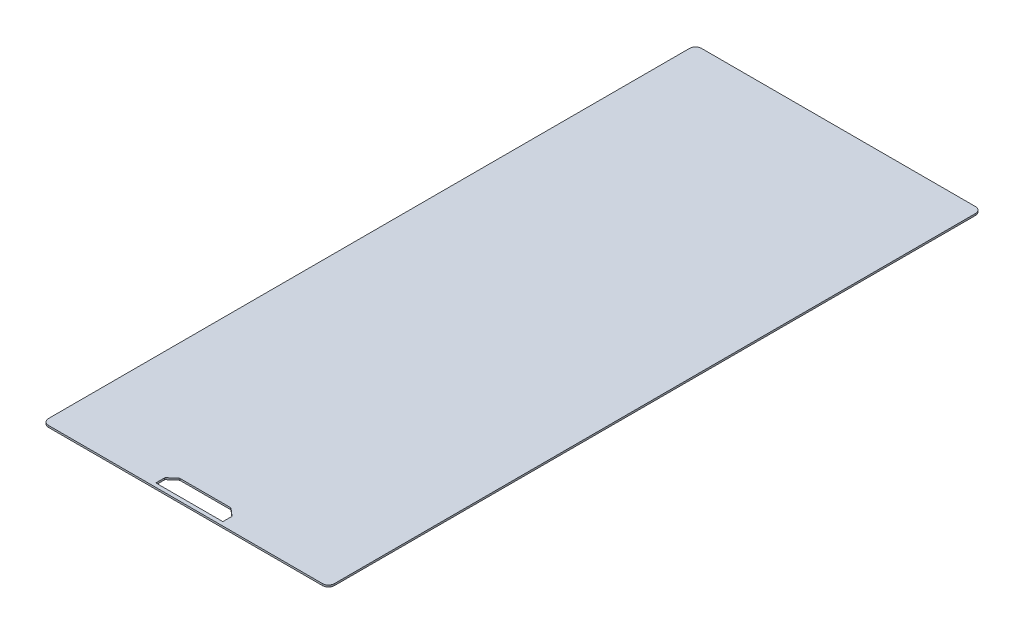
ISO-10303-21;
HEADER;
FILE_DESCRIPTION(('STEP AP214'),'2;1');
FILE_NAME('part.step','',(''),(''),'','','');
FILE_SCHEMA(('AUTOMOTIVE_DESIGN { 1 0 10303 214 1 1 1 1 }'));
ENDSEC;
DATA;
#1=APPLICATION_CONTEXT('core data for automotive mechanical design processes');
#2=APPLICATION_PROTOCOL_DEFINITION('international standard','automotive_design',2000,#1);
#3=PRODUCT_CONTEXT('',#1,'mechanical');
#4=PRODUCT('Part','Part','',(#3));
#5=PRODUCT_RELATED_PRODUCT_CATEGORY('part','',(#4));
#6=PRODUCT_DEFINITION_FORMATION('','',#4);
#7=PRODUCT_DEFINITION_CONTEXT('part definition',#1,'design');
#8=PRODUCT_DEFINITION('design','',#6,#7);
#9=PRODUCT_DEFINITION_SHAPE('','',#8);
#10=(LENGTH_UNIT() NAMED_UNIT(*) SI_UNIT(.MILLI.,.METRE.));
#11=(NAMED_UNIT(*) PLANE_ANGLE_UNIT() SI_UNIT($,.RADIAN.));
#12=(NAMED_UNIT(*) SI_UNIT($,.STERADIAN.) SOLID_ANGLE_UNIT());
#13=UNCERTAINTY_MEASURE_WITH_UNIT(LENGTH_MEASURE(1.E-05),#10,'distance_accuracy_value','');
#14=(GEOMETRIC_REPRESENTATION_CONTEXT(3) GLOBAL_UNCERTAINTY_ASSIGNED_CONTEXT((#13)) GLOBAL_UNIT_ASSIGNED_CONTEXT((#10,
#11,#12)) REPRESENTATION_CONTEXT('',''));
#15=CARTESIAN_POINT('',(0.,0.,0.));
#16=DIRECTION('',(0.,0.,1.));
#17=DIRECTION('',(1.,0.,0.));
#18=AXIS2_PLACEMENT_3D('',#15,#16,#17);
#19=CARTESIAN_POINT('',(231.5,3.,541.5));
#20=DIRECTION('',(0.,-1.,0.));
#21=DIRECTION('',(0.,0.,-1.));
#22=AXIS2_PLACEMENT_3D('',#19,#20,#21);
#23=CYLINDRICAL_SURFACE('',#22,10.);
#24=CARTESIAN_POINT('',(231.5,0.,541.5));
#25=DIRECTION('',(0.,1.,0.));
#26=DIRECTION('',(0.,0.,1.));
#27=AXIS2_PLACEMENT_3D('',#24,#25,#26);
#28=CIRCLE('',#27,10.);
#29=CARTESIAN_POINT('',(231.5,0.,551.5));
#30=VERTEX_POINT('',#29);
#31=CARTESIAN_POINT('',(241.5,0.,541.5));
#32=VERTEX_POINT('',#31);
#33=EDGE_CURVE('E254',#30,#32,#28,.T.);
#34=ORIENTED_EDGE('',*,*,#33,.T.);
#35=DIRECTION('',(0.,-1.,0.));
#36=VECTOR('',#35,1.);
#37=CARTESIAN_POINT('',(241.5,3.,541.5));
#38=LINE('',#37,#36);
#39=CARTESIAN_POINT('',(241.5,3.,541.5));
#40=VERTEX_POINT('',#39);
#41=EDGE_CURVE('E11',#40,#32,#38,.T.);
#42=ORIENTED_EDGE('',*,*,#41,.F.);
#43=CARTESIAN_POINT('',(231.5,3.,541.5));
#44=DIRECTION('',(0.,1.,0.));
#45=DIRECTION('',(0.,0.,1.));
#46=AXIS2_PLACEMENT_3D('',#43,#44,#45);
#47=CIRCLE('',#46,10.);
#48=CARTESIAN_POINT('',(231.5,3.,551.5));
#49=VERTEX_POINT('',#48);
#50=EDGE_CURVE('E278',#49,#40,#47,.T.);
#51=ORIENTED_EDGE('',*,*,#50,.F.);
#52=DIRECTION('',(0.,-1.,0.));
#53=VECTOR('',#52,1.);
#54=CARTESIAN_POINT('',(231.5,3.,551.5));
#55=LINE('',#54,#53);
#56=EDGE_CURVE('E304',#49,#30,#55,.T.);
#57=ORIENTED_EDGE('',*,*,#56,.T.);
#58=EDGE_LOOP('',(#34,#42,#51,#57));
#59=FACE_BOUND('',#58,.T.);
#60=ADVANCED_FACE('F38',(#59),#23,.T.);
#61=CARTESIAN_POINT('',(241.5,3.,541.5));
#62=DIRECTION('',(-1.,0.,0.));
#63=DIRECTION('',(0.,0.,1.));
#64=AXIS2_PLACEMENT_3D('',#61,#62,#63);
#65=PLANE('',#64);
#66=DIRECTION('',(0.,0.,-1.));
#67=VECTOR('',#66,1.);
#68=CARTESIAN_POINT('',(241.5,0.,541.5));
#69=LINE('',#68,#67);
#70=CARTESIAN_POINT('',(241.5,0.,-541.5));
#71=VERTEX_POINT('',#70);
#72=EDGE_CURVE('E308',#32,#71,#69,.T.);
#73=ORIENTED_EDGE('',*,*,#72,.T.);
#74=DIRECTION('',(0.,-1.,0.));
#75=VECTOR('',#74,1.);
#76=CARTESIAN_POINT('',(241.5,3.,-541.5));
#77=LINE('',#76,#75);
#78=CARTESIAN_POINT('',(241.5,3.,-541.5));
#79=VERTEX_POINT('',#78);
#80=EDGE_CURVE('E46',#79,#71,#77,.T.);
#81=ORIENTED_EDGE('',*,*,#80,.F.);
#82=DIRECTION('',(0.,0.,-1.));
#83=VECTOR('',#82,1.);
#84=CARTESIAN_POINT('',(241.5,3.,541.5));
#85=LINE('',#84,#83);
#86=EDGE_CURVE('E282',#40,#79,#85,.T.);
#87=ORIENTED_EDGE('',*,*,#86,.F.);
#88=ORIENTED_EDGE('',*,*,#41,.T.);
#89=EDGE_LOOP('',(#73,#81,#87,#88));
#90=FACE_BOUND('',#89,.T.);
#91=ADVANCED_FACE('F377',(#90),#65,.F.);
#92=CARTESIAN_POINT('',(231.5,3.,-541.5));
#93=DIRECTION('',(0.,-1.,0.));
#94=DIRECTION('',(0.,0.,-1.));
#95=AXIS2_PLACEMENT_3D('',#92,#93,#94);
#96=CYLINDRICAL_SURFACE('',#95,10.);
#97=CARTESIAN_POINT('',(231.5,0.,-541.5));
#98=DIRECTION('',(0.,1.,0.));
#99=DIRECTION('',(0.,0.,-1.));
#100=AXIS2_PLACEMENT_3D('',#97,#98,#99);
#101=CIRCLE('',#100,10.);
#102=CARTESIAN_POINT('',(231.5,0.,-551.5));
#103=VERTEX_POINT('',#102);
#104=EDGE_CURVE('E311',#71,#103,#101,.T.);
#105=ORIENTED_EDGE('',*,*,#104,.T.);
#106=DIRECTION('',(0.,-1.,0.));
#107=VECTOR('',#106,1.);
#108=CARTESIAN_POINT('',(231.5,3.,-551.5));
#109=LINE('',#108,#107);
#110=CARTESIAN_POINT('',(231.5,3.,-551.5));
#111=VERTEX_POINT('',#110);
#112=EDGE_CURVE('E347',#111,#103,#109,.T.);
#113=ORIENTED_EDGE('',*,*,#112,.F.);
#114=CARTESIAN_POINT('',(231.5,3.,-541.5));
#115=DIRECTION('',(0.,1.,0.));
#116=DIRECTION('',(0.,0.,-1.));
#117=AXIS2_PLACEMENT_3D('',#114,#115,#116);
#118=CIRCLE('',#117,10.);
#119=EDGE_CURVE('E286',#79,#111,#118,.T.);
#120=ORIENTED_EDGE('',*,*,#119,.F.);
#121=ORIENTED_EDGE('',*,*,#80,.T.);
#122=EDGE_LOOP('',(#105,#113,#120,#121));
#123=FACE_BOUND('',#122,.T.);
#124=ADVANCED_FACE('F356',(#123),#96,.T.);
#125=CARTESIAN_POINT('',(-231.5,3.,-551.5));
#126=DIRECTION('',(0.,0.,1.));
#127=DIRECTION('',(1.,0.,0.));
#128=AXIS2_PLACEMENT_3D('',#125,#126,#127);
#129=PLANE('',#128);
#130=DIRECTION('',(-1.,0.,0.));
#131=VECTOR('',#130,1.);
#132=CARTESIAN_POINT('',(-231.5,0.,-551.5));
#133=LINE('',#132,#131);
#134=CARTESIAN_POINT('',(-231.5,0.,-551.5));
#135=VERTEX_POINT('',#134);
#136=EDGE_CURVE('E314',#103,#135,#133,.T.);
#137=ORIENTED_EDGE('',*,*,#136,.T.);
#138=DIRECTION('',(0.,-1.,0.));
#139=VECTOR('',#138,1.);
#140=CARTESIAN_POINT('',(-231.5,3.,-551.5));
#141=LINE('',#140,#139);
#142=CARTESIAN_POINT('',(-231.5,3.,-551.5));
#143=VERTEX_POINT('',#142);
#144=EDGE_CURVE('E343',#143,#135,#141,.T.);
#145=ORIENTED_EDGE('',*,*,#144,.F.);
#146=DIRECTION('',(-1.,0.,0.));
#147=VECTOR('',#146,1.);
#148=CARTESIAN_POINT('',(-231.5,3.,-551.5));
#149=LINE('',#148,#147);
#150=EDGE_CURVE('E289',#111,#143,#149,.T.);
#151=ORIENTED_EDGE('',*,*,#150,.F.);
#152=ORIENTED_EDGE('',*,*,#112,.T.);
#153=EDGE_LOOP('',(#137,#145,#151,#152));
#154=FACE_BOUND('',#153,.T.);
#155=ADVANCED_FACE('F365',(#154),#129,.F.);
#156=CARTESIAN_POINT('',(-231.5,3.,-541.5));
#157=DIRECTION('',(0.,-1.,0.));
#158=DIRECTION('',(0.,0.,-1.));
#159=AXIS2_PLACEMENT_3D('',#156,#157,#158);
#160=CYLINDRICAL_SURFACE('',#159,10.);
#161=CARTESIAN_POINT('',(-231.5,0.,-541.5));
#162=DIRECTION('',(0.,1.,0.));
#163=DIRECTION('',(0.,0.,-1.));
#164=AXIS2_PLACEMENT_3D('',#161,#162,#163);
#165=CIRCLE('',#164,10.);
#166=CARTESIAN_POINT('',(-241.5,0.,-541.5));
#167=VERTEX_POINT('',#166);
#168=EDGE_CURVE('E317',#135,#167,#165,.T.);
#169=ORIENTED_EDGE('',*,*,#168,.T.);
#170=DIRECTION('',(0.,-1.,0.));
#171=VECTOR('',#170,1.);
#172=CARTESIAN_POINT('',(-241.5,3.,-541.5));
#173=LINE('',#172,#171);
#174=CARTESIAN_POINT('',(-241.5,3.,-541.5));
#175=VERTEX_POINT('',#174);
#176=EDGE_CURVE('E339',#175,#167,#173,.T.);
#177=ORIENTED_EDGE('',*,*,#176,.F.);
#178=CARTESIAN_POINT('',(-231.5,3.,-541.5));
#179=DIRECTION('',(0.,1.,0.));
#180=DIRECTION('',(0.,0.,-1.));
#181=AXIS2_PLACEMENT_3D('',#178,#179,#180);
#182=CIRCLE('',#181,10.);
#183=EDGE_CURVE('E292',#143,#175,#182,.T.);
#184=ORIENTED_EDGE('',*,*,#183,.F.);
#185=ORIENTED_EDGE('',*,*,#144,.T.);
#186=EDGE_LOOP('',(#169,#177,#184,#185));
#187=FACE_BOUND('',#186,.T.);
#188=ADVANCED_FACE('F369',(#187),#160,.T.);
#189=CARTESIAN_POINT('',(-241.5,3.,541.5));
#190=DIRECTION('',(1.,0.,0.));
#191=DIRECTION('',(0.,0.,-1.));
#192=AXIS2_PLACEMENT_3D('',#189,#190,#191);
#193=PLANE('',#192);
#194=DIRECTION('',(0.,0.,1.));
#195=VECTOR('',#194,1.);
#196=CARTESIAN_POINT('',(-241.5,0.,541.5));
#197=LINE('',#196,#195);
#198=CARTESIAN_POINT('',(-241.5,0.,541.5));
#199=VERTEX_POINT('',#198);
#200=EDGE_CURVE('E320',#167,#199,#197,.T.);
#201=ORIENTED_EDGE('',*,*,#200,.T.);
#202=DIRECTION('',(0.,-1.,0.));
#203=VECTOR('',#202,1.);
#204=CARTESIAN_POINT('',(-241.5,3.,541.5));
#205=LINE('',#204,#203);
#206=CARTESIAN_POINT('',(-241.5,3.,541.5));
#207=VERTEX_POINT('',#206);
#208=EDGE_CURVE('E335',#207,#199,#205,.T.);
#209=ORIENTED_EDGE('',*,*,#208,.F.);
#210=DIRECTION('',(0.,0.,1.));
#211=VECTOR('',#210,1.);
#212=CARTESIAN_POINT('',(-241.5,3.,541.5));
#213=LINE('',#212,#211);
#214=EDGE_CURVE('E295',#175,#207,#213,.T.);
#215=ORIENTED_EDGE('',*,*,#214,.F.);
#216=ORIENTED_EDGE('',*,*,#176,.T.);
#217=EDGE_LOOP('',(#201,#209,#215,#216));
#218=FACE_BOUND('',#217,.T.);
#219=ADVANCED_FACE('F390',(#218),#193,.F.);
#220=CARTESIAN_POINT('',(-231.5,3.,541.5));
#221=DIRECTION('',(0.,-1.,0.));
#222=DIRECTION('',(0.,0.,-1.));
#223=AXIS2_PLACEMENT_3D('',#220,#221,#222);
#224=CYLINDRICAL_SURFACE('',#223,10.);
#225=CARTESIAN_POINT('',(-231.5,0.,541.5));
#226=DIRECTION('',(0.,1.,0.));
#227=DIRECTION('',(0.,0.,-1.));
#228=AXIS2_PLACEMENT_3D('',#225,#226,#227);
#229=CIRCLE('',#228,10.);
#230=CARTESIAN_POINT('',(-231.5,0.,551.5));
#231=VERTEX_POINT('',#230);
#232=EDGE_CURVE('E323',#199,#231,#229,.T.);
#233=ORIENTED_EDGE('',*,*,#232,.T.);
#234=DIRECTION('',(0.,-1.,0.));
#235=VECTOR('',#234,1.);
#236=CARTESIAN_POINT('',(-231.5,3.,551.5));
#237=LINE('',#236,#235);
#238=CARTESIAN_POINT('',(-231.5,3.,551.5));
#239=VERTEX_POINT('',#238);
#240=EDGE_CURVE('E331',#239,#231,#237,.T.);
#241=ORIENTED_EDGE('',*,*,#240,.F.);
#242=CARTESIAN_POINT('',(-231.5,3.,541.5));
#243=DIRECTION('',(0.,1.,0.));
#244=DIRECTION('',(0.,0.,-1.));
#245=AXIS2_PLACEMENT_3D('',#242,#243,#244);
#246=CIRCLE('',#245,10.);
#247=EDGE_CURVE('E298',#207,#239,#246,.T.);
#248=ORIENTED_EDGE('',*,*,#247,.F.);
#249=ORIENTED_EDGE('',*,*,#208,.T.);
#250=EDGE_LOOP('',(#233,#241,#248,#249));
#251=FACE_BOUND('',#250,.T.);
#252=ADVANCED_FACE('F388',(#251),#224,.T.);
#253=CARTESIAN_POINT('',(-231.5,3.,551.5));
#254=DIRECTION('',(0.,0.,-1.));
#255=DIRECTION('',(-1.,0.,0.));
#256=AXIS2_PLACEMENT_3D('',#253,#254,#255);
#257=PLANE('',#256);
#258=DIRECTION('',(1.,0.,0.));
#259=VECTOR('',#258,1.);
#260=CARTESIAN_POINT('',(-231.5,0.,551.5));
#261=LINE('',#260,#259);
#262=EDGE_CURVE('E283',#231,#30,#261,.T.);
#263=ORIENTED_EDGE('',*,*,#262,.T.);
#264=ORIENTED_EDGE('',*,*,#56,.F.);
#265=DIRECTION('',(1.,0.,0.));
#266=VECTOR('',#265,1.);
#267=CARTESIAN_POINT('',(-231.5,3.,551.5));
#268=LINE('',#267,#266);
#269=EDGE_CURVE('E301',#239,#49,#268,.T.);
#270=ORIENTED_EDGE('',*,*,#269,.F.);
#271=ORIENTED_EDGE('',*,*,#240,.T.);
#272=EDGE_LOOP('',(#263,#264,#270,#271));
#273=FACE_BOUND('',#272,.T.);
#274=ADVANCED_FACE('F383',(#273),#257,.F.);
#275=CARTESIAN_POINT('',(231.5,3.,541.5));
#276=DIRECTION('',(0.,1.,0.));
#277=DIRECTION('',(0.,0.,1.));
#278=AXIS2_PLACEMENT_3D('',#275,#276,#277);
#279=PLANE('',#278);
#280=DIRECTION('',(0.,0.,-1.));
#281=VECTOR('',#280,1.);
#282=CARTESIAN_POINT('',(56.625,3.,545.));
#283=LINE('',#282,#281);
#284=CARTESIAN_POINT('',(56.625,3.,545.));
#285=VERTEX_POINT('',#284);
#286=CARTESIAN_POINT('',(56.625,3.,530.644630073536));
#287=VERTEX_POINT('',#286);
#288=EDGE_CURVE('E53',#285,#287,#283,.T.);
#289=ORIENTED_EDGE('',*,*,#288,.F.);
#290=DIRECTION('',(1.,0.,0.));
#291=VECTOR('',#290,1.);
#292=CARTESIAN_POINT('',(-56.625,3.,545.));
#293=LINE('',#292,#291);
#294=CARTESIAN_POINT('',(-56.625,3.,545.));
#295=VERTEX_POINT('',#294);
#296=EDGE_CURVE('E185',#295,#285,#293,.T.);
#297=ORIENTED_EDGE('',*,*,#296,.F.);
#298=DIRECTION('',(0.,0.,1.));
#299=VECTOR('',#298,1.);
#300=CARTESIAN_POINT('',(-56.625,3.,530.644630073536));
#301=LINE('',#300,#299);
#302=CARTESIAN_POINT('',(-56.625,3.,530.644630073536));
#303=VERTEX_POINT('',#302);
#304=EDGE_CURVE('E189',#303,#295,#301,.T.);
#305=ORIENTED_EDGE('',*,*,#304,.F.);
#306=CARTESIAN_POINT('',(-54.125,3.,530.644630073536));
#307=DIRECTION('',(0.,1.,0.));
#308=DIRECTION('',(0.,0.,1.));
#309=AXIS2_PLACEMENT_3D('',#306,#307,#308);
#310=CIRCLE('',#309,2.49999999999994);
#311=CARTESIAN_POINT('',(-55.7585005575696,3.,528.752098454667));
#312=VERTEX_POINT('',#311);
#313=EDGE_CURVE('E244',#312,#303,#310,.T.);
#314=ORIENTED_EDGE('',*,*,#313,.F.);
#315=DIRECTION('',(-0.757012647547708,0.,0.653400223027824));
#316=VECTOR('',#315,1.);
#317=CARTESIAN_POINT('',(-44.0051937791101,3.,518.607468381131));
#318=LINE('',#317,#316);
#319=CARTESIAN_POINT('',(-44.0051937791101,3.,518.607468381131));
#320=VERTEX_POINT('',#319);
#321=EDGE_CURVE('E240',#320,#312,#318,.T.);
#322=ORIENTED_EDGE('',*,*,#321,.F.);
#323=CARTESIAN_POINT('',(-42.3716932215407,3.,520.5));
#324=DIRECTION('',(0.,1.,0.));
#325=DIRECTION('',(0.,0.,1.));
#326=AXIS2_PLACEMENT_3D('',#323,#324,#325);
#327=CIRCLE('',#326,2.4999999999999);
#328=CARTESIAN_POINT('',(-42.3716932215407,3.,518.));
#329=VERTEX_POINT('',#328);
#330=EDGE_CURVE('E236',#329,#320,#327,.T.);
#331=ORIENTED_EDGE('',*,*,#330,.F.);
#332=DIRECTION('',(-1.,0.,0.));
#333=VECTOR('',#332,1.);
#334=CARTESIAN_POINT('',(42.3716932215407,3.,518.));
#335=LINE('',#334,#333);
#336=CARTESIAN_POINT('',(42.3716932215407,3.,518.));
#337=VERTEX_POINT('',#336);
#338=EDGE_CURVE('E232',#337,#329,#335,.T.);
#339=ORIENTED_EDGE('',*,*,#338,.F.);
#340=CARTESIAN_POINT('',(42.3716932215407,3.,520.5));
#341=DIRECTION('',(0.,1.,0.));
#342=DIRECTION('',(0.,0.,1.));
#343=AXIS2_PLACEMENT_3D('',#340,#341,#342);
#344=CIRCLE('',#343,2.49999999999997);
#345=CARTESIAN_POINT('',(44.0051937791102,3.,518.607468381131));
#346=VERTEX_POINT('',#345);
#347=EDGE_CURVE('E228',#346,#337,#344,.T.);
#348=ORIENTED_EDGE('',*,*,#347,.F.);
#349=DIRECTION('',(-0.757012647547708,0.,-0.653400223027824));
#350=VECTOR('',#349,1.);
#351=CARTESIAN_POINT('',(55.7585005575696,3.,528.752098454667));
#352=LINE('',#351,#350);
#353=CARTESIAN_POINT('',(55.7585005575696,3.,528.752098454667));
#354=VERTEX_POINT('',#353);
#355=EDGE_CURVE('E224',#354,#346,#352,.T.);
#356=ORIENTED_EDGE('',*,*,#355,.F.);
#357=CARTESIAN_POINT('',(54.125,3.,530.644630073536));
#358=DIRECTION('',(0.,1.,0.));
#359=DIRECTION('',(0.,0.,1.));
#360=AXIS2_PLACEMENT_3D('',#357,#358,#359);
#361=CIRCLE('',#360,2.50000000000001);
#362=EDGE_CURVE('E221',#287,#354,#361,.T.);
#363=ORIENTED_EDGE('',*,*,#362,.F.);
#364=EDGE_LOOP('',(#289,#297,#305,#314,#322,#331,#339,#348,#356,#363));
#365=FACE_BOUND('',#364,.T.);
#366=ORIENTED_EDGE('',*,*,#50,.T.);
#367=ORIENTED_EDGE('',*,*,#86,.T.);
#368=ORIENTED_EDGE('',*,*,#119,.T.);
#369=ORIENTED_EDGE('',*,*,#150,.T.);
#370=ORIENTED_EDGE('',*,*,#183,.T.);
#371=ORIENTED_EDGE('',*,*,#214,.T.);
#372=ORIENTED_EDGE('',*,*,#247,.T.);
#373=ORIENTED_EDGE('',*,*,#269,.T.);
#374=EDGE_LOOP('',(#366,#367,#368,#369,#370,#371,#372,#373));
#375=FACE_BOUND('',#374,.T.);
#376=ADVANCED_FACE('F373',(#365,#375),#279,.T.);
#377=CARTESIAN_POINT('',(231.5,0.,541.5));
#378=DIRECTION('',(0.,1.,0.));
#379=DIRECTION('',(0.,0.,1.));
#380=AXIS2_PLACEMENT_3D('',#377,#378,#379);
#381=PLANE('',#380);
#382=DIRECTION('',(1.,0.,0.));
#383=VECTOR('',#382,1.);
#384=CARTESIAN_POINT('',(-56.625,0.,545.));
#385=LINE('',#384,#383);
#386=CARTESIAN_POINT('',(-56.625,0.,545.));
#387=VERTEX_POINT('',#386);
#388=CARTESIAN_POINT('',(56.625,0.,545.));
#389=VERTEX_POINT('',#388);
#390=EDGE_CURVE('E172',#387,#389,#385,.T.);
#391=ORIENTED_EDGE('',*,*,#390,.T.);
#392=DIRECTION('',(0.,0.,-1.));
#393=VECTOR('',#392,1.);
#394=CARTESIAN_POINT('',(56.625,0.,545.));
#395=LINE('',#394,#393);
#396=CARTESIAN_POINT('',(56.625,0.,530.644630073536));
#397=VERTEX_POINT('',#396);
#398=EDGE_CURVE('E165',#389,#397,#395,.T.);
#399=ORIENTED_EDGE('',*,*,#398,.T.);
#400=CARTESIAN_POINT('',(54.125,0.,530.644630073536));
#401=DIRECTION('',(0.,1.,0.));
#402=DIRECTION('',(0.,0.,1.));
#403=AXIS2_PLACEMENT_3D('',#400,#401,#402);
#404=CIRCLE('',#403,2.50000000000001);
#405=CARTESIAN_POINT('',(55.7585005575696,0.,528.752098454667));
#406=VERTEX_POINT('',#405);
#407=EDGE_CURVE('E175',#397,#406,#404,.T.);
#408=ORIENTED_EDGE('',*,*,#407,.T.);
#409=DIRECTION('',(-0.757012647547708,0.,-0.653400223027824));
#410=VECTOR('',#409,1.);
#411=CARTESIAN_POINT('',(55.7585005575696,0.,528.752098454667));
#412=LINE('',#411,#410);
#413=CARTESIAN_POINT('',(44.0051937791102,0.,518.607468381131));
#414=VERTEX_POINT('',#413);
#415=EDGE_CURVE('E61',#406,#414,#412,.T.);
#416=ORIENTED_EDGE('',*,*,#415,.T.);
#417=CARTESIAN_POINT('',(42.3716932215407,0.,520.5));
#418=DIRECTION('',(0.,1.,0.));
#419=DIRECTION('',(0.,0.,1.));
#420=AXIS2_PLACEMENT_3D('',#417,#418,#419);
#421=CIRCLE('',#420,2.49999999999997);
#422=CARTESIAN_POINT('',(42.3716932215407,0.,518.));
#423=VERTEX_POINT('',#422);
#424=EDGE_CURVE('E194',#414,#423,#421,.T.);
#425=ORIENTED_EDGE('',*,*,#424,.T.);
#426=DIRECTION('',(-1.,0.,0.));
#427=VECTOR('',#426,1.);
#428=CARTESIAN_POINT('',(42.3716932215407,0.,518.));
#429=LINE('',#428,#427);
#430=CARTESIAN_POINT('',(-42.3716932215407,0.,518.));
#431=VERTEX_POINT('',#430);
#432=EDGE_CURVE('E198',#423,#431,#429,.T.);
#433=ORIENTED_EDGE('',*,*,#432,.T.);
#434=CARTESIAN_POINT('',(-42.3716932215407,0.,520.5));
#435=DIRECTION('',(0.,1.,0.));
#436=DIRECTION('',(0.,0.,1.));
#437=AXIS2_PLACEMENT_3D('',#434,#435,#436);
#438=CIRCLE('',#437,2.4999999999999);
#439=CARTESIAN_POINT('',(-44.0051937791101,0.,518.607468381131));
#440=VERTEX_POINT('',#439);
#441=EDGE_CURVE('E202',#431,#440,#438,.T.);
#442=ORIENTED_EDGE('',*,*,#441,.T.);
#443=DIRECTION('',(-0.757012647547708,0.,0.653400223027824));
#444=VECTOR('',#443,1.);
#445=CARTESIAN_POINT('',(-44.0051937791101,0.,518.607468381131));
#446=LINE('',#445,#444);
#447=CARTESIAN_POINT('',(-55.7585005575696,0.,528.752098454667));
#448=VERTEX_POINT('',#447);
#449=EDGE_CURVE('E206',#440,#448,#446,.T.);
#450=ORIENTED_EDGE('',*,*,#449,.T.);
#451=CARTESIAN_POINT('',(-54.125,0.,530.644630073536));
#452=DIRECTION('',(0.,1.,0.));
#453=DIRECTION('',(0.,0.,1.));
#454=AXIS2_PLACEMENT_3D('',#451,#452,#453);
#455=CIRCLE('',#454,2.49999999999994);
#456=CARTESIAN_POINT('',(-56.625,0.,530.644630073536));
#457=VERTEX_POINT('',#456);
#458=EDGE_CURVE('E210',#448,#457,#455,.T.);
#459=ORIENTED_EDGE('',*,*,#458,.T.);
#460=DIRECTION('',(0.,0.,1.));
#461=VECTOR('',#460,1.);
#462=CARTESIAN_POINT('',(-56.625,0.,530.644630073536));
#463=LINE('',#462,#461);
#464=EDGE_CURVE('E214',#457,#387,#463,.T.);
#465=ORIENTED_EDGE('',*,*,#464,.T.);
#466=EDGE_LOOP('',(#391,#399,#408,#416,#425,#433,#442,#450,#459,#465));
#467=FACE_BOUND('',#466,.T.);
#468=ORIENTED_EDGE('',*,*,#33,.F.);
#469=ORIENTED_EDGE('',*,*,#262,.F.);
#470=ORIENTED_EDGE('',*,*,#232,.F.);
#471=ORIENTED_EDGE('',*,*,#200,.F.);
#472=ORIENTED_EDGE('',*,*,#168,.F.);
#473=ORIENTED_EDGE('',*,*,#136,.F.);
#474=ORIENTED_EDGE('',*,*,#104,.F.);
#475=ORIENTED_EDGE('',*,*,#72,.F.);
#476=EDGE_LOOP('',(#468,#469,#470,#471,#472,#473,#474,#475));
#477=FACE_BOUND('',#476,.T.);
#478=ADVANCED_FACE('F180',(#467,#477),#381,.F.);
#479=CARTESIAN_POINT('',(56.625,0.,545.));
#480=DIRECTION('',(1.,0.,0.));
#481=DIRECTION('',(0.,0.,-1.));
#482=AXIS2_PLACEMENT_3D('',#479,#480,#481);
#483=PLANE('',#482);
#484=ORIENTED_EDGE('',*,*,#288,.T.);
#485=DIRECTION('',(0.,1.,0.));
#486=VECTOR('',#485,1.);
#487=CARTESIAN_POINT('',(56.625,0.,530.644630073536));
#488=LINE('',#487,#486);
#489=EDGE_CURVE('E161',#397,#287,#488,.T.);
#490=ORIENTED_EDGE('',*,*,#489,.F.);
#491=ORIENTED_EDGE('',*,*,#398,.F.);
#492=DIRECTION('',(0.,1.,0.));
#493=VECTOR('',#492,1.);
#494=CARTESIAN_POINT('',(56.625,0.,545.));
#495=LINE('',#494,#493);
#496=EDGE_CURVE('E251',#389,#285,#495,.T.);
#497=ORIENTED_EDGE('',*,*,#496,.T.);
#498=EDGE_LOOP('',(#484,#490,#491,#497));
#499=FACE_BOUND('',#498,.T.);
#500=ADVANCED_FACE('F163',(#499),#483,.F.);
#501=CARTESIAN_POINT('',(-56.625,0.,545.));
#502=DIRECTION('',(0.,0.,1.));
#503=DIRECTION('',(1.,0.,0.));
#504=AXIS2_PLACEMENT_3D('',#501,#502,#503);
#505=PLANE('',#504);
#506=ORIENTED_EDGE('',*,*,#296,.T.);
#507=ORIENTED_EDGE('',*,*,#496,.F.);
#508=ORIENTED_EDGE('',*,*,#390,.F.);
#509=DIRECTION('',(0.,1.,0.));
#510=VECTOR('',#509,1.);
#511=CARTESIAN_POINT('',(-56.625,0.,545.));
#512=LINE('',#511,#510);
#513=EDGE_CURVE('E255',#387,#295,#512,.T.);
#514=ORIENTED_EDGE('',*,*,#513,.T.);
#515=EDGE_LOOP('',(#506,#507,#508,#514));
#516=FACE_BOUND('',#515,.T.);
#517=ADVANCED_FACE('F461',(#516),#505,.F.);
#518=CARTESIAN_POINT('',(-56.625,0.,530.644630073536));
#519=DIRECTION('',(-1.,0.,0.));
#520=DIRECTION('',(0.,0.,1.));
#521=AXIS2_PLACEMENT_3D('',#518,#519,#520);
#522=PLANE('',#521);
#523=ORIENTED_EDGE('',*,*,#304,.T.);
#524=ORIENTED_EDGE('',*,*,#513,.F.);
#525=ORIENTED_EDGE('',*,*,#464,.F.);
#526=DIRECTION('',(0.,1.,0.));
#527=VECTOR('',#526,1.);
#528=CARTESIAN_POINT('',(-56.625,0.,530.644630073536));
#529=LINE('',#528,#527);
#530=EDGE_CURVE('E258',#457,#303,#529,.T.);
#531=ORIENTED_EDGE('',*,*,#530,.T.);
#532=EDGE_LOOP('',(#523,#524,#525,#531));
#533=FACE_BOUND('',#532,.T.);
#534=ADVANCED_FACE('F470',(#533),#522,.F.);
#535=CARTESIAN_POINT('',(-54.125,0.,530.644630073536));
#536=DIRECTION('',(0.,1.,0.));
#537=DIRECTION('',(0.,0.,1.));
#538=AXIS2_PLACEMENT_3D('',#535,#536,#537);
#539=CYLINDRICAL_SURFACE('',#538,2.49999999999994);
#540=ORIENTED_EDGE('',*,*,#313,.T.);
#541=ORIENTED_EDGE('',*,*,#530,.F.);
#542=ORIENTED_EDGE('',*,*,#458,.F.);
#543=DIRECTION('',(0.,1.,0.));
#544=VECTOR('',#543,1.);
#545=CARTESIAN_POINT('',(-55.7585005575696,0.,528.752098454667));
#546=LINE('',#545,#544);
#547=EDGE_CURVE('E261',#448,#312,#546,.T.);
#548=ORIENTED_EDGE('',*,*,#547,.T.);
#549=EDGE_LOOP('',(#540,#541,#542,#548));
#550=FACE_BOUND('',#549,.T.);
#551=ADVANCED_FACE('F480',(#550),#539,.F.);
#552=CARTESIAN_POINT('',(-44.0051937791101,0.,518.607468381131));
#553=DIRECTION('',(-0.653400223027824,0.,-0.757012647547708));
#554=DIRECTION('',(-0.757012647547708,0.,0.653400223027824));
#555=AXIS2_PLACEMENT_3D('',#552,#553,#554);
#556=PLANE('',#555);
#557=ORIENTED_EDGE('',*,*,#321,.T.);
#558=ORIENTED_EDGE('',*,*,#547,.F.);
#559=ORIENTED_EDGE('',*,*,#449,.F.);
#560=DIRECTION('',(0.,1.,0.));
#561=VECTOR('',#560,1.);
#562=CARTESIAN_POINT('',(-44.0051937791101,0.,518.607468381131));
#563=LINE('',#562,#561);
#564=EDGE_CURVE('E264',#440,#320,#563,.T.);
#565=ORIENTED_EDGE('',*,*,#564,.T.);
#566=EDGE_LOOP('',(#557,#558,#559,#565));
#567=FACE_BOUND('',#566,.T.);
#568=ADVANCED_FACE('F490',(#567),#556,.F.);
#569=CARTESIAN_POINT('',(-42.3716932215407,0.,520.5));
#570=DIRECTION('',(0.,1.,0.));
#571=DIRECTION('',(0.,0.,1.));
#572=AXIS2_PLACEMENT_3D('',#569,#570,#571);
#573=CYLINDRICAL_SURFACE('',#572,2.4999999999999);
#574=ORIENTED_EDGE('',*,*,#330,.T.);
#575=ORIENTED_EDGE('',*,*,#564,.F.);
#576=ORIENTED_EDGE('',*,*,#441,.F.);
#577=DIRECTION('',(0.,1.,0.));
#578=VECTOR('',#577,1.);
#579=CARTESIAN_POINT('',(-42.3716932215407,0.,518.));
#580=LINE('',#579,#578);
#581=EDGE_CURVE('E267',#431,#329,#580,.T.);
#582=ORIENTED_EDGE('',*,*,#581,.T.);
#583=EDGE_LOOP('',(#574,#575,#576,#582));
#584=FACE_BOUND('',#583,.T.);
#585=ADVANCED_FACE('F500',(#584),#573,.F.);
#586=CARTESIAN_POINT('',(42.3716932215407,0.,518.));
#587=DIRECTION('',(0.,0.,-1.));
#588=DIRECTION('',(-1.,0.,0.));
#589=AXIS2_PLACEMENT_3D('',#586,#587,#588);
#590=PLANE('',#589);
#591=ORIENTED_EDGE('',*,*,#338,.T.);
#592=ORIENTED_EDGE('',*,*,#581,.F.);
#593=ORIENTED_EDGE('',*,*,#432,.F.);
#594=DIRECTION('',(0.,1.,0.));
#595=VECTOR('',#594,1.);
#596=CARTESIAN_POINT('',(42.3716932215407,0.,518.));
#597=LINE('',#596,#595);
#598=EDGE_CURVE('E270',#423,#337,#597,.T.);
#599=ORIENTED_EDGE('',*,*,#598,.T.);
#600=EDGE_LOOP('',(#591,#592,#593,#599));
#601=FACE_BOUND('',#600,.T.);
#602=ADVANCED_FACE('F510',(#601),#590,.F.);
#603=CARTESIAN_POINT('',(42.3716932215407,0.,520.5));
#604=DIRECTION('',(0.,1.,0.));
#605=DIRECTION('',(0.,0.,1.));
#606=AXIS2_PLACEMENT_3D('',#603,#604,#605);
#607=CYLINDRICAL_SURFACE('',#606,2.49999999999997);
#608=ORIENTED_EDGE('',*,*,#347,.T.);
#609=ORIENTED_EDGE('',*,*,#598,.F.);
#610=ORIENTED_EDGE('',*,*,#424,.F.);
#611=DIRECTION('',(0.,1.,0.));
#612=VECTOR('',#611,1.);
#613=CARTESIAN_POINT('',(44.0051937791102,0.,518.607468381131));
#614=LINE('',#613,#612);
#615=EDGE_CURVE('E273',#414,#346,#614,.T.);
#616=ORIENTED_EDGE('',*,*,#615,.T.);
#617=EDGE_LOOP('',(#608,#609,#610,#616));
#618=FACE_BOUND('',#617,.T.);
#619=ADVANCED_FACE('F520',(#618),#607,.F.);
#620=CARTESIAN_POINT('',(55.7585005575696,0.,528.752098454667));
#621=DIRECTION('',(0.653400223027824,0.,-0.757012647547708));
#622=DIRECTION('',(-0.757012647547708,0.,-0.653400223027824));
#623=AXIS2_PLACEMENT_3D('',#620,#621,#622);
#624=PLANE('',#623);
#625=ORIENTED_EDGE('',*,*,#355,.T.);
#626=ORIENTED_EDGE('',*,*,#615,.F.);
#627=ORIENTED_EDGE('',*,*,#415,.F.);
#628=DIRECTION('',(0.,1.,0.));
#629=VECTOR('',#628,1.);
#630=CARTESIAN_POINT('',(55.7585005575696,0.,528.752098454667));
#631=LINE('',#630,#629);
#632=EDGE_CURVE('E171',#406,#354,#631,.T.);
#633=ORIENTED_EDGE('',*,*,#632,.T.);
#634=EDGE_LOOP('',(#625,#626,#627,#633));
#635=FACE_BOUND('',#634,.T.);
#636=ADVANCED_FACE('F530',(#635),#624,.F.);
#637=CARTESIAN_POINT('',(54.125,0.,530.644630073536));
#638=DIRECTION('',(0.,1.,0.));
#639=DIRECTION('',(0.,0.,1.));
#640=AXIS2_PLACEMENT_3D('',#637,#638,#639);
#641=CYLINDRICAL_SURFACE('',#640,2.50000000000001);
#642=ORIENTED_EDGE('',*,*,#362,.T.);
#643=ORIENTED_EDGE('',*,*,#632,.F.);
#644=ORIENTED_EDGE('',*,*,#407,.F.);
#645=ORIENTED_EDGE('',*,*,#489,.T.);
#646=EDGE_LOOP('',(#642,#643,#644,#645));
#647=FACE_BOUND('',#646,.T.);
#648=ADVANCED_FACE('F176',(#647),#641,.F.);
#649=CLOSED_SHELL('',(#60,#91,#124,#155,#188,#219,#252,#274,#376,#478,#500,#517,#534,#551,#568,
#585,#602,#619,#636,#648));
#650=MANIFOLD_SOLID_BREP('B2',#649);
#651=ADVANCED_BREP_SHAPE_REPRESENTATION('',(#18,#650),#14);
#652=SHAPE_DEFINITION_REPRESENTATION(#9,#651);
ENDSEC;
END-ISO-10303-21;
